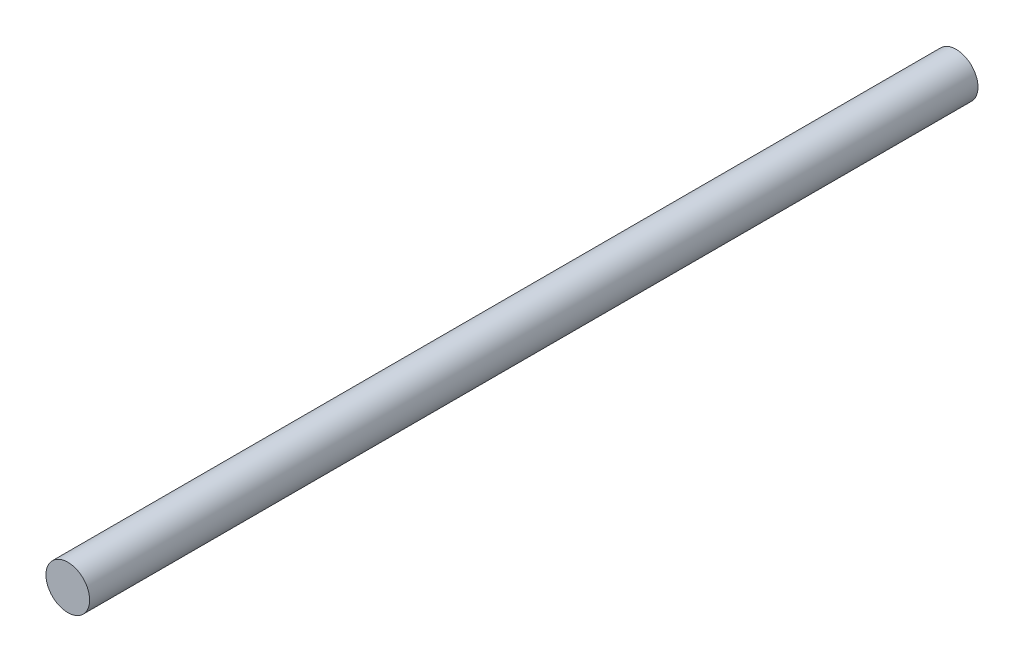
ISO-10303-21;
HEADER;
FILE_DESCRIPTION(('STEP AP214'),'2;1');
FILE_NAME('part.step','',(''),(''),'','','');
FILE_SCHEMA(('AUTOMOTIVE_DESIGN { 1 0 10303 214 1 1 1 1 }'));
ENDSEC;
DATA;
#1=APPLICATION_CONTEXT('core data for automotive mechanical design processes');
#2=APPLICATION_PROTOCOL_DEFINITION('international standard','automotive_design',2000,#1);
#3=PRODUCT_CONTEXT('',#1,'mechanical');
#4=PRODUCT('Part','Part','',(#3));
#5=PRODUCT_RELATED_PRODUCT_CATEGORY('part','',(#4));
#6=PRODUCT_DEFINITION_FORMATION('','',#4);
#7=PRODUCT_DEFINITION_CONTEXT('part definition',#1,'design');
#8=PRODUCT_DEFINITION('design','',#6,#7);
#9=PRODUCT_DEFINITION_SHAPE('','',#8);
#10=(LENGTH_UNIT() NAMED_UNIT(*) SI_UNIT(.MILLI.,.METRE.));
#11=(NAMED_UNIT(*) PLANE_ANGLE_UNIT() SI_UNIT($,.RADIAN.));
#12=(NAMED_UNIT(*) SI_UNIT($,.STERADIAN.) SOLID_ANGLE_UNIT());
#13=UNCERTAINTY_MEASURE_WITH_UNIT(LENGTH_MEASURE(1.E-05),#10,'distance_accuracy_value','');
#14=(GEOMETRIC_REPRESENTATION_CONTEXT(3) GLOBAL_UNCERTAINTY_ASSIGNED_CONTEXT((#13)) GLOBAL_UNIT_ASSIGNED_CONTEXT((#10,
#11,#12)) REPRESENTATION_CONTEXT('',''));
#15=CARTESIAN_POINT('',(0.,0.,0.));
#16=DIRECTION('',(0.,0.,1.));
#17=DIRECTION('',(1.,0.,0.));
#18=AXIS2_PLACEMENT_3D('',#15,#16,#17);
#19=CARTESIAN_POINT('',(0.,0.,122.));
#20=DIRECTION('',(0.,0.,-1.));
#21=DIRECTION('',(-1.,0.,0.));
#22=AXIS2_PLACEMENT_3D('',#19,#20,#21);
#23=CYLINDRICAL_SURFACE('',#22,3.);
#24=CARTESIAN_POINT('',(0.,0.,122.));
#25=DIRECTION('',(0.,0.,1.));
#26=DIRECTION('',(1.,0.,0.));
#27=AXIS2_PLACEMENT_3D('',#24,#25,#26);
#28=CIRCLE('',#27,3.);
#29=CARTESIAN_POINT('',(3.,0.,122.));
#30=VERTEX_POINT('',#29);
#31=EDGE_CURVE('E10',#30,#30,#28,.T.);
#32=ORIENTED_EDGE('',*,*,#31,.F.);
#33=EDGE_LOOP('',(#32));
#34=FACE_BOUND('',#33,.T.);
#35=CARTESIAN_POINT('',(0.,0.,0.));
#36=DIRECTION('',(0.,0.,1.));
#37=DIRECTION('',(1.,0.,0.));
#38=AXIS2_PLACEMENT_3D('',#35,#36,#37);
#39=CIRCLE('',#38,3.);
#40=CARTESIAN_POINT('',(3.,0.,0.));
#41=VERTEX_POINT('',#40);
#42=EDGE_CURVE('E35',#41,#41,#39,.T.);
#43=ORIENTED_EDGE('',*,*,#42,.T.);
#44=EDGE_LOOP('',(#43));
#45=FACE_BOUND('',#44,.T.);
#46=ADVANCED_FACE('F32',(#34,#45),#23,.T.);
#47=CARTESIAN_POINT('',(0.,0.,122.));
#48=DIRECTION('',(0.,0.,1.));
#49=DIRECTION('',(1.,0.,0.));
#50=AXIS2_PLACEMENT_3D('',#47,#48,#49);
#51=PLANE('',#50);
#52=ORIENTED_EDGE('',*,*,#31,.T.);
#53=EDGE_LOOP('',(#52));
#54=FACE_BOUND('',#53,.T.);
#55=ADVANCED_FACE('F47',(#54),#51,.T.);
#56=CARTESIAN_POINT('',(0.,0.,0.));
#57=DIRECTION('',(0.,0.,1.));
#58=DIRECTION('',(1.,0.,0.));
#59=AXIS2_PLACEMENT_3D('',#56,#57,#58);
#60=PLANE('',#59);
#61=ORIENTED_EDGE('',*,*,#42,.F.);
#62=EDGE_LOOP('',(#61));
#63=FACE_BOUND('',#62,.T.);
#64=ADVANCED_FACE('F45',(#63),#60,.F.);
#65=CLOSED_SHELL('',(#46,#55,#64));
#66=MANIFOLD_SOLID_BREP('B2',#65);
#67=ADVANCED_BREP_SHAPE_REPRESENTATION('',(#18,#66),#14);
#68=SHAPE_DEFINITION_REPRESENTATION(#9,#67);
ENDSEC;
END-ISO-10303-21;
